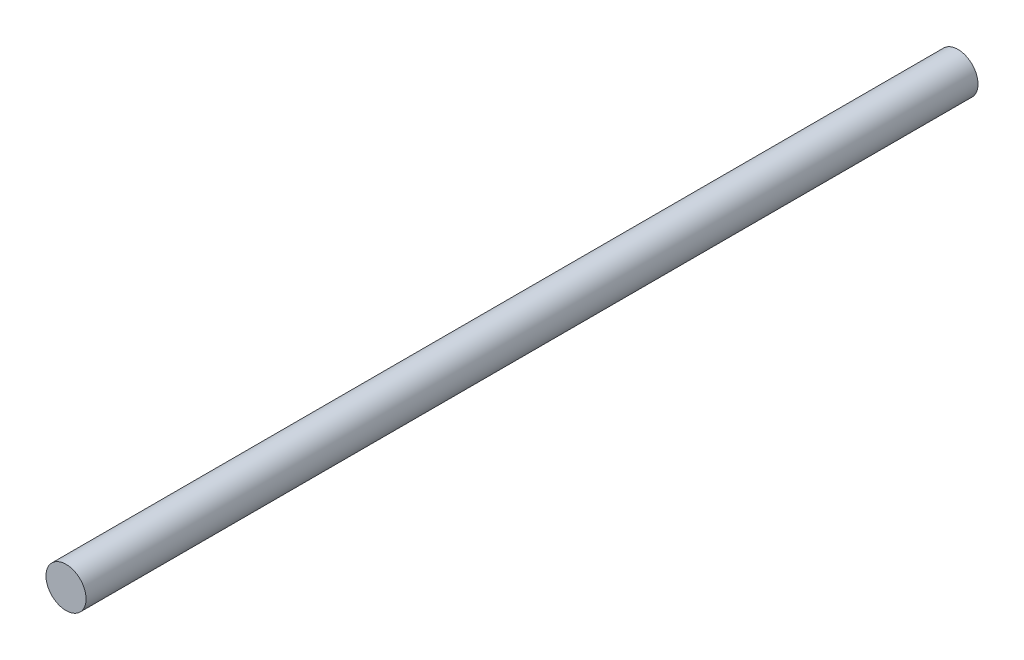
ISO-10303-21;
HEADER;
FILE_DESCRIPTION(('STEP AP214'),'2;1');
FILE_NAME('part.step','',(''),(''),'','','');
FILE_SCHEMA(('AUTOMOTIVE_DESIGN { 1 0 10303 214 1 1 1 1 }'));
ENDSEC;
DATA;
#1=APPLICATION_CONTEXT('core data for automotive mechanical design processes');
#2=APPLICATION_PROTOCOL_DEFINITION('international standard','automotive_design',2000,#1);
#3=PRODUCT_CONTEXT('',#1,'mechanical');
#4=PRODUCT('Part','Part','',(#3));
#5=PRODUCT_RELATED_PRODUCT_CATEGORY('part','',(#4));
#6=PRODUCT_DEFINITION_FORMATION('','',#4);
#7=PRODUCT_DEFINITION_CONTEXT('part definition',#1,'design');
#8=PRODUCT_DEFINITION('design','',#6,#7);
#9=PRODUCT_DEFINITION_SHAPE('','',#8);
#10=(LENGTH_UNIT() NAMED_UNIT(*) SI_UNIT(.MILLI.,.METRE.));
#11=(NAMED_UNIT(*) PLANE_ANGLE_UNIT() SI_UNIT($,.RADIAN.));
#12=(NAMED_UNIT(*) SI_UNIT($,.STERADIAN.) SOLID_ANGLE_UNIT());
#13=UNCERTAINTY_MEASURE_WITH_UNIT(LENGTH_MEASURE(1.E-05),#10,'distance_accuracy_value','');
#14=(GEOMETRIC_REPRESENTATION_CONTEXT(3) GLOBAL_UNCERTAINTY_ASSIGNED_CONTEXT((#13)) GLOBAL_UNIT_ASSIGNED_CONTEXT((#10,
#11,#12)) REPRESENTATION_CONTEXT('',''));
#15=CARTESIAN_POINT('',(0.,0.,0.));
#16=DIRECTION('',(0.,0.,1.));
#17=DIRECTION('',(1.,0.,0.));
#18=AXIS2_PLACEMENT_3D('',#15,#16,#17);
#19=CARTESIAN_POINT('',(0.,0.,88.9));
#20=DIRECTION('',(0.,0.,-1.));
#21=DIRECTION('',(-1.,0.,0.));
#22=AXIS2_PLACEMENT_3D('',#19,#20,#21);
#23=CYLINDRICAL_SURFACE('',#22,4.);
#24=CARTESIAN_POINT('',(0.,0.,88.9));
#25=DIRECTION('',(0.,0.,1.));
#26=DIRECTION('',(1.,0.,0.));
#27=AXIS2_PLACEMENT_3D('',#24,#25,#26);
#28=CIRCLE('',#27,4.);
#29=CARTESIAN_POINT('',(4.,0.,88.9));
#30=VERTEX_POINT('',#29);
#31=EDGE_CURVE('E10',#30,#30,#28,.T.);
#32=ORIENTED_EDGE('',*,*,#31,.F.);
#33=EDGE_LOOP('',(#32));
#34=FACE_BOUND('',#33,.T.);
#35=CARTESIAN_POINT('',(0.,0.,-88.9));
#36=DIRECTION('',(0.,0.,1.));
#37=DIRECTION('',(1.,0.,0.));
#38=AXIS2_PLACEMENT_3D('',#35,#36,#37);
#39=CIRCLE('',#38,4.);
#40=CARTESIAN_POINT('',(4.,0.,-88.9));
#41=VERTEX_POINT('',#40);
#42=EDGE_CURVE('E38',#41,#41,#39,.T.);
#43=ORIENTED_EDGE('',*,*,#42,.T.);
#44=EDGE_LOOP('',(#43));
#45=FACE_BOUND('',#44,.T.);
#46=ADVANCED_FACE('F35',(#34,#45),#23,.T.);
#47=CARTESIAN_POINT('',(0.,0.,88.9));
#48=DIRECTION('',(0.,0.,1.));
#49=DIRECTION('',(1.,0.,0.));
#50=AXIS2_PLACEMENT_3D('',#47,#48,#49);
#51=PLANE('',#50);
#52=ORIENTED_EDGE('',*,*,#31,.T.);
#53=EDGE_LOOP('',(#52));
#54=FACE_BOUND('',#53,.T.);
#55=ADVANCED_FACE('F50',(#54),#51,.T.);
#56=CARTESIAN_POINT('',(0.,0.,-88.9));
#57=DIRECTION('',(0.,0.,1.));
#58=DIRECTION('',(1.,0.,0.));
#59=AXIS2_PLACEMENT_3D('',#56,#57,#58);
#60=PLANE('',#59);
#61=ORIENTED_EDGE('',*,*,#42,.F.);
#62=EDGE_LOOP('',(#61));
#63=FACE_BOUND('',#62,.T.);
#64=ADVANCED_FACE('F48',(#63),#60,.F.);
#65=CLOSED_SHELL('',(#46,#55,#64));
#66=MANIFOLD_SOLID_BREP('B2',#65);
#67=ADVANCED_BREP_SHAPE_REPRESENTATION('',(#18,#66),#14);
#68=SHAPE_DEFINITION_REPRESENTATION(#9,#67);
ENDSEC;
END-ISO-10303-21;
